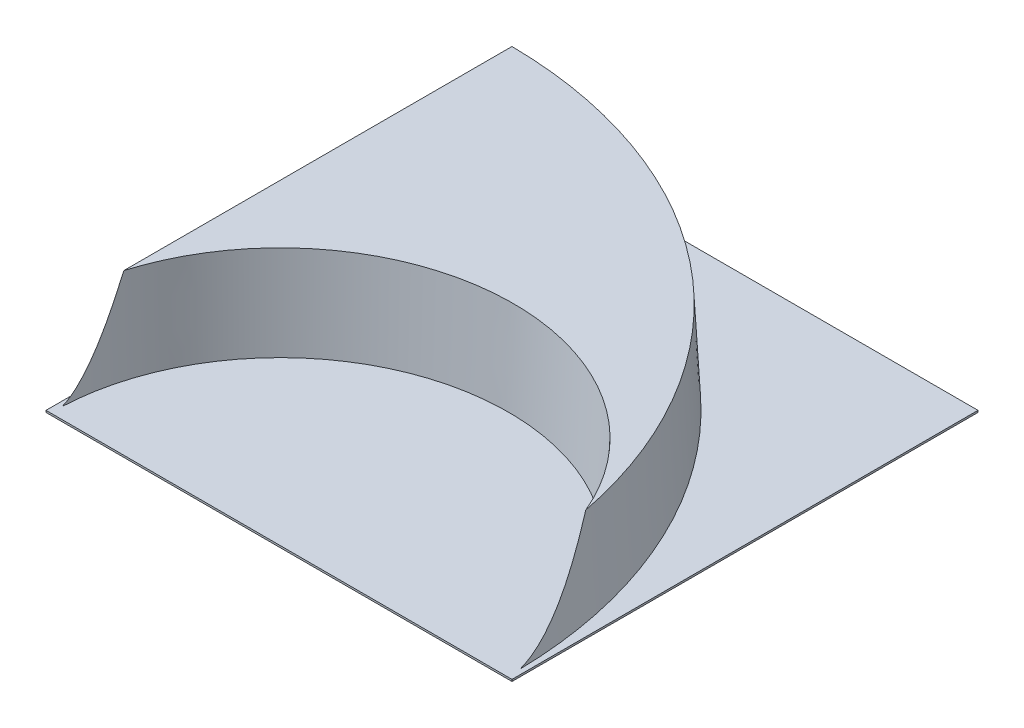
ISO-10303-21;
HEADER;
FILE_DESCRIPTION(('STEP AP214'),'2;1');
FILE_NAME('part.step','',(''),(''),'','','');
FILE_SCHEMA(('AUTOMOTIVE_DESIGN { 1 0 10303 214 1 1 1 1 }'));
ENDSEC;
DATA;
#1=APPLICATION_CONTEXT('core data for automotive mechanical design processes');
#2=APPLICATION_PROTOCOL_DEFINITION('international standard','automotive_design',2000,#1);
#3=PRODUCT_CONTEXT('',#1,'mechanical');
#4=PRODUCT('Part','Part','',(#3));
#5=PRODUCT_RELATED_PRODUCT_CATEGORY('part','',(#4));
#6=PRODUCT_DEFINITION_FORMATION('','',#4);
#7=PRODUCT_DEFINITION_CONTEXT('part definition',#1,'design');
#8=PRODUCT_DEFINITION('design','',#6,#7);
#9=PRODUCT_DEFINITION_SHAPE('','',#8);
#10=(LENGTH_UNIT() NAMED_UNIT(*) SI_UNIT(.MILLI.,.METRE.));
#11=(NAMED_UNIT(*) PLANE_ANGLE_UNIT() SI_UNIT($,.RADIAN.));
#12=(NAMED_UNIT(*) SI_UNIT($,.STERADIAN.) SOLID_ANGLE_UNIT());
#13=UNCERTAINTY_MEASURE_WITH_UNIT(LENGTH_MEASURE(1.E-05),#10,'distance_accuracy_value','');
#14=(GEOMETRIC_REPRESENTATION_CONTEXT(3) GLOBAL_UNCERTAINTY_ASSIGNED_CONTEXT((#13)) GLOBAL_UNIT_ASSIGNED_CONTEXT((#10,
#11,#12)) REPRESENTATION_CONTEXT('',''));
#15=CARTESIAN_POINT('',(0.,0.,0.));
#16=DIRECTION('',(0.,0.,1.));
#17=DIRECTION('',(1.,0.,0.));
#18=AXIS2_PLACEMENT_3D('',#15,#16,#17);
#19=CARTESIAN_POINT('',(-249.,-2.,-249.));
#20=DIRECTION('',(0.,0.,1.));
#21=DIRECTION('',(1.,0.,0.));
#22=AXIS2_PLACEMENT_3D('',#19,#20,#21);
#23=PLANE('',#22);
#24=DIRECTION('',(1.,0.,0.));
#25=VECTOR('',#24,1.);
#26=CARTESIAN_POINT('',(-249.,0.,-249.));
#27=LINE('',#26,#25);
#28=CARTESIAN_POINT('',(-249.,0.,-249.));
#29=VERTEX_POINT('',#28);
#30=CARTESIAN_POINT('',(249.,0.,-249.));
#31=VERTEX_POINT('',#30);
#32=EDGE_CURVE('E187',#29,#31,#27,.T.);
#33=ORIENTED_EDGE('',*,*,#32,.T.);
#34=DIRECTION('',(0.,1.,0.));
#35=VECTOR('',#34,1.);
#36=CARTESIAN_POINT('',(249.,-2.,-249.));
#37=LINE('',#36,#35);
#38=CARTESIAN_POINT('',(249.,-2.,-249.));
#39=VERTEX_POINT('',#38);
#40=EDGE_CURVE('E249',#39,#31,#37,.T.);
#41=ORIENTED_EDGE('',*,*,#40,.F.);
#42=DIRECTION('',(1.,0.,0.));
#43=VECTOR('',#42,1.);
#44=CARTESIAN_POINT('',(-249.,-2.,-249.));
#45=LINE('',#44,#43);
#46=CARTESIAN_POINT('',(-249.,-2.,-249.));
#47=VERTEX_POINT('',#46);
#48=EDGE_CURVE('E217',#47,#39,#45,.T.);
#49=ORIENTED_EDGE('',*,*,#48,.F.);
#50=DIRECTION('',(0.,1.,0.));
#51=VECTOR('',#50,1.);
#52=CARTESIAN_POINT('',(-249.,-2.,-249.));
#53=LINE('',#52,#51);
#54=EDGE_CURVE('E231',#47,#29,#53,.T.);
#55=ORIENTED_EDGE('',*,*,#54,.T.);
#56=EDGE_LOOP('',(#33,#41,#49,#55));
#57=FACE_BOUND('',#56,.T.);
#58=ADVANCED_FACE('F43',(#57),#23,.F.);
#59=CARTESIAN_POINT('',(249.,-2.,-249.));
#60=DIRECTION('',(-1.,0.,0.));
#61=DIRECTION('',(0.,0.,1.));
#62=AXIS2_PLACEMENT_3D('',#59,#60,#61);
#63=PLANE('',#62);
#64=DIRECTION('',(0.,0.,1.));
#65=VECTOR('',#64,1.);
#66=CARTESIAN_POINT('',(249.,0.,-249.));
#67=LINE('',#66,#65);
#68=CARTESIAN_POINT('',(249.,0.,249.));
#69=VERTEX_POINT('',#68);
#70=EDGE_CURVE('E234',#31,#69,#67,.T.);
#71=ORIENTED_EDGE('',*,*,#70,.T.);
#72=DIRECTION('',(0.,1.,0.));
#73=VECTOR('',#72,1.);
#74=CARTESIAN_POINT('',(249.,-2.,249.));
#75=LINE('',#74,#73);
#76=CARTESIAN_POINT('',(249.,-2.,249.));
#77=VERTEX_POINT('',#76);
#78=EDGE_CURVE('E247',#77,#69,#75,.T.);
#79=ORIENTED_EDGE('',*,*,#78,.F.);
#80=DIRECTION('',(0.,0.,1.));
#81=VECTOR('',#80,1.);
#82=CARTESIAN_POINT('',(249.,-2.,-249.));
#83=LINE('',#82,#81);
#84=EDGE_CURVE('E220',#39,#77,#83,.T.);
#85=ORIENTED_EDGE('',*,*,#84,.F.);
#86=ORIENTED_EDGE('',*,*,#40,.T.);
#87=EDGE_LOOP('',(#71,#79,#85,#86));
#88=FACE_BOUND('',#87,.T.);
#89=ADVANCED_FACE('F272',(#88),#63,.F.);
#90=CARTESIAN_POINT('',(-249.,-2.,249.));
#91=DIRECTION('',(0.,0.,1.));
#92=DIRECTION('',(1.,0.,0.));
#93=AXIS2_PLACEMENT_3D('',#90,#91,#92);
#94=PLANE('',#93);
#95=DIRECTION('',(1.,0.,0.));
#96=VECTOR('',#95,1.);
#97=CARTESIAN_POINT('',(-249.,0.,249.));
#98=LINE('',#97,#96);
#99=CARTESIAN_POINT('',(-249.,0.,249.));
#100=VERTEX_POINT('',#99);
#101=EDGE_CURVE('E238',#100,#69,#98,.T.);
#102=ORIENTED_EDGE('',*,*,#101,.F.);
#103=DIRECTION('',(0.,1.,0.));
#104=VECTOR('',#103,1.);
#105=CARTESIAN_POINT('',(-249.,-2.,249.));
#106=LINE('',#105,#104);
#107=CARTESIAN_POINT('',(-249.,-2.,249.));
#108=VERTEX_POINT('',#107);
#109=EDGE_CURVE('E245',#108,#100,#106,.T.);
#110=ORIENTED_EDGE('',*,*,#109,.F.);
#111=DIRECTION('',(1.,0.,0.));
#112=VECTOR('',#111,1.);
#113=CARTESIAN_POINT('',(-249.,-2.,249.));
#114=LINE('',#113,#112);
#115=EDGE_CURVE('E224',#108,#77,#114,.T.);
#116=ORIENTED_EDGE('',*,*,#115,.T.);
#117=ORIENTED_EDGE('',*,*,#78,.T.);
#118=EDGE_LOOP('',(#102,#110,#116,#117));
#119=FACE_BOUND('',#118,.T.);
#120=ADVANCED_FACE('F277',(#119),#94,.T.);
#121=CARTESIAN_POINT('',(-249.,-2.,-249.));
#122=DIRECTION('',(-1.,0.,0.));
#123=DIRECTION('',(0.,0.,1.));
#124=AXIS2_PLACEMENT_3D('',#121,#122,#123);
#125=PLANE('',#124);
#126=DIRECTION('',(0.,0.,1.));
#127=VECTOR('',#126,1.);
#128=CARTESIAN_POINT('',(-249.,0.,-249.));
#129=LINE('',#128,#127);
#130=EDGE_CURVE('E221',#29,#100,#129,.T.);
#131=ORIENTED_EDGE('',*,*,#130,.F.);
#132=ORIENTED_EDGE('',*,*,#54,.F.);
#133=DIRECTION('',(0.,0.,1.));
#134=VECTOR('',#133,1.);
#135=CARTESIAN_POINT('',(-249.,-2.,-249.));
#136=LINE('',#135,#134);
#137=EDGE_CURVE('E227',#47,#108,#136,.T.);
#138=ORIENTED_EDGE('',*,*,#137,.T.);
#139=ORIENTED_EDGE('',*,*,#109,.T.);
#140=EDGE_LOOP('',(#131,#132,#138,#139));
#141=FACE_BOUND('',#140,.T.);
#142=ADVANCED_FACE('F284',(#141),#125,.T.);
#143=CARTESIAN_POINT('',(0.,-2.,0.));
#144=DIRECTION('',(0.,-1.,0.));
#145=DIRECTION('',(0.,0.,-1.));
#146=AXIS2_PLACEMENT_3D('',#143,#144,#145);
#147=PLANE('',#146);
#148=CARTESIAN_POINT('',(-244.,-2.,244.));
#149=DIRECTION('',(0.,-1.,0.));
#150=DIRECTION('',(0.,0.,-1.));
#151=AXIS2_PLACEMENT_3D('',#148,#149,#150);
#152=CIRCLE('',#151,485.997255308004);
#153=CARTESIAN_POINT('',(-241.997255308004,-2.,-241.993128738063));
#154=VERTEX_POINT('',#153);
#155=CARTESIAN_POINT('',(238.830659233703,-2.,188.611493332449));
#156=VERTEX_POINT('',#155);
#157=EDGE_CURVE('E134',#154,#156,#152,.T.);
#158=ORIENTED_EDGE('',*,*,#157,.F.);
#159=DIRECTION('',(0.,0.,-1.));
#160=VECTOR('',#159,1.);
#161=CARTESIAN_POINT('',(-241.997255308004,-2.,0.));
#162=LINE('',#161,#160);
#163=CARTESIAN_POINT('',(-241.997255308004,-2.,203.329265280194));
#164=VERTEX_POINT('',#163);
#165=EDGE_CURVE('E119',#164,#154,#162,.T.);
#166=ORIENTED_EDGE('',*,*,#165,.F.);
#167=CARTESIAN_POINT('',(0.,-2.,247.696543837481));
#168=DIRECTION('',(0.,-1.,0.));
#169=DIRECTION('',(0.,0.,-1.));
#170=AXIS2_PLACEMENT_3D('',#167,#168,#169);
#171=CIRCLE('',#170,246.030743979664);
#172=EDGE_CURVE('E129',#164,#156,#171,.T.);
#173=ORIENTED_EDGE('',*,*,#172,.T.);
#174=EDGE_LOOP('',(#158,#166,#173));
#175=FACE_BOUND('',#174,.T.);
#176=ORIENTED_EDGE('',*,*,#48,.T.);
#177=ORIENTED_EDGE('',*,*,#84,.T.);
#178=ORIENTED_EDGE('',*,*,#115,.F.);
#179=ORIENTED_EDGE('',*,*,#137,.F.);
#180=EDGE_LOOP('',(#176,#177,#178,#179));
#181=FACE_BOUND('',#180,.T.);
#182=ADVANCED_FACE('F142',(#175,#181),#147,.T.);
#183=CARTESIAN_POINT('',(0.,0.,0.));
#184=DIRECTION('',(0.,-1.,0.));
#185=DIRECTION('',(0.,0.,-1.));
#186=AXIS2_PLACEMENT_3D('',#183,#184,#185);
#187=PLANE('',#186);
#188=CARTESIAN_POINT('',(0.,0.,247.696543837481));
#189=DIRECTION('',(0.,-1.,0.));
#190=DIRECTION('',(0.,0.,-1.));
#191=AXIS2_PLACEMENT_3D('',#188,#189,#190);
#192=CIRCLE('',#191,244.132814846235);
#193=CARTESIAN_POINT('',(-243.895184441434,-1.82865569106182E-13,236.927593516077));
#194=VERTEX_POINT('',#193);
#195=CARTESIAN_POINT('',(243.817466479364,0.,235.291934842022));
#196=VERTEX_POINT('',#195);
#197=EDGE_CURVE('E51',#194,#196,#192,.T.);
#198=ORIENTED_EDGE('',*,*,#197,.F.);
#199=DIRECTION('',(0.,0.,-1.));
#200=VECTOR('',#199,1.);
#201=CARTESIAN_POINT('',(-243.895184441434,0.,0.));
#202=LINE('',#201,#200);
#203=CARTESIAN_POINT('',(-243.895184441434,0.,-243.895173182559));
#204=VERTEX_POINT('',#203);
#205=EDGE_CURVE('E11',#194,#204,#202,.T.);
#206=ORIENTED_EDGE('',*,*,#205,.T.);
#207=CARTESIAN_POINT('',(-244.,0.,244.));
#208=DIRECTION('',(0.,-1.,0.));
#209=DIRECTION('',(0.,0.,-1.));
#210=AXIS2_PLACEMENT_3D('',#207,#208,#209);
#211=CIRCLE('',#210,487.895184441434);
#212=EDGE_CURVE('E252',#204,#196,#211,.T.);
#213=ORIENTED_EDGE('',*,*,#212,.T.);
#214=EDGE_LOOP('',(#198,#206,#213));
#215=FACE_BOUND('',#214,.T.);
#216=ORIENTED_EDGE('',*,*,#32,.F.);
#217=ORIENTED_EDGE('',*,*,#130,.T.);
#218=ORIENTED_EDGE('',*,*,#101,.T.);
#219=ORIENTED_EDGE('',*,*,#70,.F.);
#220=EDGE_LOOP('',(#216,#217,#218,#219));
#221=FACE_BOUND('',#220,.T.);
#222=ADVANCED_FACE('F258',(#215,#221),#187,.F.);
#223=CARTESIAN_POINT('',(-244.,-2.,244.));
#224=DIRECTION('',(-0.998629534754574,0.0523359562429439,0.));
#225=DIRECTION('',(-0.052335956242944,-0.998629534754574,0.));
#226=AXIS2_PLACEMENT_3D('',#223,#224,#225);
#227=PLANE('',#226);
#228=ORIENTED_EDGE('',*,*,#205,.F.);
#229=CARTESIAN_POINT('',(-238.759222071696,98.,176.079805776711));
#230=CARTESIAN_POINT('',(-238.848955156247,96.2877907482616,176.691310067576));
#231=CARTESIAN_POINT('',(-238.938559773883,94.578032791302,177.309724481718));
#232=CARTESIAN_POINT('',(-239.11748579046,91.1639210120117,178.561427647303));
#233=CARTESIAN_POINT('',(-239.206807184096,89.4595672908911,179.19471667547));
#234=CARTESIAN_POINT('',(-239.385166522264,86.0562683797866,180.477411886047));
#235=CARTESIAN_POINT('',(-239.474204363631,84.3573251582805,181.126823313486));
#236=CARTESIAN_POINT('',(-239.651931847282,80.9660827495771,182.442769835081));
#237=CARTESIAN_POINT('',(-239.740621491151,79.2737835321122,183.109304851124));
#238=CARTESIAN_POINT('',(-240.007801784323,74.1756798378286,185.149455745489));
#239=CARTESIAN_POINT('',(-240.185703422998,70.7811143533115,186.551451776626));
#240=CARTESIAN_POINT('',(-240.539506960993,64.030140684213,189.443722049961));
#241=CARTESIAN_POINT('',(-240.715409134595,60.6737272660483,190.933984005587));
#242=CARTESIAN_POINT('',(-241.051253737399,54.265430494109,193.902133912563));
#243=CARTESIAN_POINT('',(-241.211384491914,51.2099536793043,195.372184813923));
#244=CARTESIAN_POINT('',(-241.449448145749,46.6674285600993,197.659308607078));
#245=CARTESIAN_POINT('',(-241.528459352436,45.1598049254529,198.435484312182));
#246=CARTESIAN_POINT('',(-241.685647178449,42.1604825316462,200.018149044492));
#247=CARTESIAN_POINT('',(-241.763823805121,40.668783632324,200.824637804615));
#248=CARTESIAN_POINT('',(-241.918916732601,37.7094342837898,202.4683318147));
#249=CARTESIAN_POINT('',(-241.995836590333,36.2417159644034,203.305414298209));
#250=CARTESIAN_POINT('',(-242.148531386854,33.3281256804762,205.01710846674));
#251=CARTESIAN_POINT('',(-242.224306277665,31.8822546314139,205.891721718569));
#252=CARTESIAN_POINT('',(-242.374440934,29.0175147323285,207.682760988633));
#253=CARTESIAN_POINT('',(-242.448801395645,27.5986325995024,208.599165642585));
#254=CARTESIAN_POINT('',(-242.595840940675,24.792950942285,210.479789024293));
#255=CARTESIAN_POINT('',(-242.668520241702,23.4061472650328,211.444001511487));
#256=CARTESIAN_POINT('',(-242.80236153309,20.8523032895875,213.296436127047));
#257=CARTESIAN_POINT('',(-242.863778566548,19.6803964792176,214.177914686048));
#258=CARTESIAN_POINT('',(-242.984713455707,17.3728213288578,215.98755398455));
#259=CARTESIAN_POINT('',(-243.044231208978,16.2371549433602,216.915717234886));
#260=CARTESIAN_POINT('',(-243.161042014851,14.0082719898807,218.827010656181));
#261=CARTESIAN_POINT('',(-243.218329758266,12.9151567272571,219.810259850827));
#262=CARTESIAN_POINT('',(-243.32992348308,10.785821610591,221.836851133305));
#263=CARTESIAN_POINT('',(-243.384229955509,9.74959238713628,222.880183266827));
#264=CARTESIAN_POINT('',(-243.47949173378,7.9318893748281,224.838603076776));
#265=CARTESIAN_POINT('',(-243.521077652974,7.13838276641191,225.742454221872));
#266=CARTESIAN_POINT('',(-243.601111114824,5.61125334126129,227.600144952351));
#267=CARTESIAN_POINT('',(-243.639558206807,4.87763912388404,228.553991683934));
#268=CARTESIAN_POINT('',(-243.712311914762,3.48941567784588,230.508944673947));
#269=CARTESIAN_POINT('',(-243.746643259019,2.83433460540917,231.509712591615));
#270=CARTESIAN_POINT('',(-243.810503123765,1.61581579734053,233.565762934681));
#271=CARTESIAN_POINT('',(-243.840034456483,1.05232440117186,234.621012959082));
#272=CARTESIAN_POINT('',(-243.882682905815,0.238543509939713,236.356352689016));
#273=CARTESIAN_POINT('',(-243.897672231486,-0.047469862041061,237.01973498916));
#274=CARTESIAN_POINT('',(-243.925236748651,-0.573432181789776,238.364373452561));
#275=CARTESIAN_POINT('',(-243.93781297835,-0.813400939703747,239.045621785124));
#276=CARTESIAN_POINT('',(-243.960416045537,-1.24469315425471,240.431243970453));
#277=CARTESIAN_POINT('',(-243.970415171622,-1.43548784583812,241.135784124614));
#278=CARTESIAN_POINT('',(-243.987476050919,-1.76102881571302,242.558636824356));
#279=CARTESIAN_POINT('',(-243.99453401872,-1.89570286406548,243.276965881398));
#280=CARTESIAN_POINT('',(-244.,-2.00000000000015,244.));
#281=B_SPLINE_CURVE_WITH_KNOTS('',3,(#229,#230,#231,#232,#233,#234,#235,#236,#237,#238,#239,
#240,#241,#242,#243,#244,#245,#246,#247,#248,#249,#250,#251,#252,#253,#254,#255,#256,#257,#258,
#259,#260,#261,#262,#263,#264,#265,#266,#267,#268,#269,#270,#271,#272,#273,#274,#275,#276,#277,
#278,#279,#280),.UNSPECIFIED.,.F.,.F.,(4,2,2,2,2,2,2,2,2,2,2,2,2,2,2,2,2,2,2,2,2,2,2,2,2,4),(0.,
5.46102829517277,10.9221582670171,16.3850887887935,21.8479943946946,32.877863160625,
43.9062001663472,54.0876907344658,59.1800131881135,64.2722907845695,69.3459945317113,
74.4199102988155,79.4912606740202,84.5619507980836,88.9640527684992,93.3663917500266,
97.7786400630557,102.190159463064,105.798472179207,109.407302069524,112.993229185091,
116.577047746115,118.743303567743,120.908625283515,123.096341120716,125.286864020207),.UNSPECIFIED.);
#282=CARTESIAN_POINT('',(-238.759222071696,98.,176.079805776711));
#283=VERTEX_POINT('',#282);
#284=EDGE_CURVE('E179',#283,#194,#281,.T.);
#285=ORIENTED_EDGE('',*,*,#284,.F.);
#286=DIRECTION('',(0.,0.,-1.));
#287=VECTOR('',#286,1.);
#288=CARTESIAN_POINT('',(-238.759222071696,98.,244.));
#289=LINE('',#288,#287);
#290=CARTESIAN_POINT('',(-238.759222071696,98.,-238.730774595918));
#291=VERTEX_POINT('',#290);
#292=EDGE_CURVE('E128',#283,#291,#289,.T.);
#293=ORIENTED_EDGE('',*,*,#292,.T.);
#294=CARTESIAN_POINT('',(-238.759222071696,98.,-238.730774595918));
#295=CARTESIAN_POINT('',(-239.632671968299,81.3335831330251,-239.613732614432));
#296=CARTESIAN_POINT('',(-240.506128410674,64.6670413652918,-240.494313740744));
#297=CARTESIAN_POINT('',(-242.253054386776,31.3337080319584,-242.25072220877));
#298=CARTESIAN_POINT('',(-243.126523920502,14.6669164663584,-243.126549550486));
#299=CARTESIAN_POINT('',(-244.,-2.00000000000001,-244.));
#300=B_SPLINE_CURVE_WITH_KNOTS('',3,(#294,#295,#296,#297,#298,#299),.UNSPECIFIED.,.F.,.F.,(4,2,
4),(0.,50.1378866123321,100.275773213684),.UNSPECIFIED.);
#301=EDGE_CURVE('E188',#291,#204,#300,.T.);
#302=ORIENTED_EDGE('',*,*,#301,.T.);
#303=EDGE_LOOP('',(#228,#285,#293,#302));
#304=FACE_BOUND('',#303,.T.);
#305=ADVANCED_FACE('F194',(#304),#227,.T.);
#306=CARTESIAN_POINT('',(0.,-2.,247.696543837481));
#307=DIRECTION('',(0.,1.,0.));
#308=DIRECTION('',(0.,0.,-1.));
#309=AXIS2_PLACEMENT_3D('',#306,#307,#308);
#310=CONICAL_SURFACE('',#309,244.027999287669,0.05235987755983);
#311=ORIENTED_EDGE('',*,*,#284,.T.);
#312=ORIENTED_EDGE('',*,*,#197,.T.);
#313=CARTESIAN_POINT('',(229.6881881763,98.,150.855129623133));
#314=CARTESIAN_POINT('',(229.977686766097,96.0674663068534,151.802499128545));
#315=CARTESIAN_POINT('',(230.266134799081,94.1404856822678,152.761581776974));
#316=CARTESIAN_POINT('',(230.840722301913,90.2987880971063,154.704853407672));
#317=CARTESIAN_POINT('',(231.126861681348,88.3840716174271,155.68904336699));
#318=CARTESIAN_POINT('',(231.696790867189,84.566944577179,157.684798048762));
#319=CARTESIAN_POINT('',(231.980578988412,82.6645430259931,158.696380503708));
#320=CARTESIAN_POINT('',(232.545350582894,78.8748210764327,160.748156283346));
#321=CARTESIAN_POINT('',(232.82633408045,76.9875005474373,161.788349359886));
#322=CARTESIAN_POINT('',(233.391003430261,73.190603221162,163.92134251124));
#323=CARTESIAN_POINT('',(233.674624244559,71.2813780347889,165.014786450731));
#324=CARTESIAN_POINT('',(234.238262602991,67.4825279815474,167.236098921902));
#325=CARTESIAN_POINT('',(234.518280187491,65.5929028951504,168.36396706746));
#326=CARTESIAN_POINT('',(235.074216400079,61.8361644551989,170.656631394868));
#327=CARTESIAN_POINT('',(235.350135970913,59.9690459432377,171.821418883967));
#328=CARTESIAN_POINT('',(235.897429910735,56.2598361213937,174.191271113535));
#329=CARTESIAN_POINT('',(236.168804284523,54.4177447850767,175.396335811458));
#330=CARTESIAN_POINT('',(236.707189771039,50.7567470748295,177.853852360117));
#331=CARTESIAN_POINT('',(236.974185665066,48.9379250442377,179.106433417569));
#332=CARTESIAN_POINT('',(237.502253690694,45.3333306212825,181.659608752403));
#333=CARTESIAN_POINT('',(237.763325771255,43.5475585136997,182.960203443214));
#334=CARTESIAN_POINT('',(238.27881935866,40.0131704553665,185.614762300449));
#335=CARTESIAN_POINT('',(238.533236314701,38.2645800750257,186.968761476268));
#336=CARTESIAN_POINT('',(239.034137344404,34.8123054267418,189.734339807296));
#337=CARTESIAN_POINT('',(239.280621570635,33.1086202952519,191.145917853909));
#338=CARTESIAN_POINT('',(239.762747393561,29.7650156004478,194.022989657267));
#339=CARTESIAN_POINT('',(239.998448799092,28.1247549275749,195.488075724478));
#340=CARTESIAN_POINT('',(240.45907219642,24.9061745568092,198.486927079611));
#341=CARTESIAN_POINT('',(240.683993229196,23.3278603719188,200.020698454376));
#342=CARTESIAN_POINT('',(241.120704264935,20.2477033591263,203.161343829054));
#343=CARTESIAN_POINT('',(241.332510974825,18.7457636894627,204.768120100839));
#344=CARTESIAN_POINT('',(241.740711278441,15.8320845232813,208.062928096471));
#345=CARTESIAN_POINT('',(241.937109310958,14.4203190721492,209.750936192062));
#346=CARTESIAN_POINT('',(242.289253544538,11.8665902518937,213.010186584791));
#347=CARTESIAN_POINT('',(242.447060227973,10.7124674658441,214.571615852727));
#348=CARTESIAN_POINT('',(242.67096226048,9.05756892315066,216.967466939023));
#349=CARTESIAN_POINT('',(242.743462943736,8.51864021190546,217.775052055215));
#350=CARTESIAN_POINT('',(242.88385116929,7.46833507295602,219.408777901653));
#351=CARTESIAN_POINT('',(242.95173689414,6.95696951631368,220.234925773757));
#352=CARTESIAN_POINT('',(243.147240790117,5.4727941270738,222.733448109387));
#353=CARTESIAN_POINT('',(243.267412148927,4.54469164952314,224.433381002598));
#354=CARTESIAN_POINT('',(243.484276314911,2.83093219419026,227.904662926892));
#355=CARTESIAN_POINT('',(243.580981686591,2.04519904425893,229.675973144976));
#356=CARTESIAN_POINT('',(243.710453130835,0.9511046956217,232.484748551047));
#357=CARTESIAN_POINT('',(243.752565762192,0.585469263494145,233.499680842003));
#358=CARTESIAN_POINT('',(243.827776795653,-0.0902495735157118,235.54801567303));
#359=CARTESIAN_POINT('',(243.860877633394,-0.400347980742159,236.581413141854));
#360=CARTESIAN_POINT('',(243.917675718331,-0.962941963506119,238.671095203705));
#361=CARTESIAN_POINT('',(243.941312259003,-1.21506139305661,239.72748312065));
#362=CARTESIAN_POINT('',(243.978415436142,-1.65596379423103,241.854223126166));
#363=CARTESIAN_POINT('',(243.991875796571,-1.84470763990533,242.924583418805));
#364=CARTESIAN_POINT('',(244.,-1.99999999999965,244.));
#365=B_SPLINE_CURVE_WITH_KNOTS('',3,(#313,#314,#315,#316,#317,#318,#319,#320,#321,#322,#323,
#324,#325,#326,#327,#328,#329,#330,#331,#332,#333,#334,#335,#336,#337,#338,#339,#340,#341,#342,
#343,#344,#345,#346,#347,#348,#349,#350,#351,#352,#353,#354,#355,#356,#357,#358,#359,#360,#361,
#362,#363,#364),.UNSPECIFIED.,.F.,.F.,(4,2,2,2,2,2,2,2,2,2,2,2,2,2,2,2,2,2,2,2,2,2,2,2,2,4),(0.,
6.51491193674741,13.0300777885528,19.5495671048448,26.0689998926318,32.723806099131,
39.3785376886027,46.0317138772123,52.6848830380626,59.3576628100299,66.0305000524329,
72.7077868591881,79.3849451650993,86.0189240002442,92.6534919017548,99.2794260316601,
105.903444361124,111.743772522794,114.664054825661,117.585480600699,123.400960698491,
129.213320080922,132.450745918821,135.68729590001,138.944285621361,142.203282417162),.UNSPECIFIED.);
#366=CARTESIAN_POINT('',(229.6881881763,98.,150.855129623133));
#367=VERTEX_POINT('',#366);
#368=EDGE_CURVE('E66',#367,#196,#365,.T.);
#369=ORIENTED_EDGE('',*,*,#368,.F.);
#370=CARTESIAN_POINT('',(0.,98.,247.696543837481));
#371=DIRECTION('',(0.,-1.,0.));
#372=DIRECTION('',(0.,0.,-1.));
#373=AXIS2_PLACEMENT_3D('',#370,#371,#372);
#374=CIRCLE('',#373,249.268777215973);
#375=EDGE_CURVE('E213',#283,#367,#374,.T.);
#376=ORIENTED_EDGE('',*,*,#375,.F.);
#377=EDGE_LOOP('',(#311,#312,#369,#376));
#378=FACE_BOUND('',#377,.T.);
#379=ADVANCED_FACE('F197',(#378),#310,.F.);
#380=CARTESIAN_POINT('',(-244.,-2.,244.));
#381=DIRECTION('',(0.,-1.,0.));
#382=DIRECTION('',(0.,0.,-1.));
#383=AXIS2_PLACEMENT_3D('',#380,#381,#382);
#384=CONICAL_SURFACE('',#383,488.,0.05235987755983);
#385=ORIENTED_EDGE('',*,*,#212,.F.);
#386=ORIENTED_EDGE('',*,*,#301,.F.);
#387=CARTESIAN_POINT('',(-244.,98.,244.));
#388=DIRECTION('',(0.,-1.,0.));
#389=DIRECTION('',(0.,0.,-1.));
#390=AXIS2_PLACEMENT_3D('',#387,#388,#389);
#391=CIRCLE('',#390,482.759222071696);
#392=EDGE_CURVE('E212',#291,#367,#391,.T.);
#393=ORIENTED_EDGE('',*,*,#392,.T.);
#394=ORIENTED_EDGE('',*,*,#368,.T.);
#395=EDGE_LOOP('',(#385,#386,#393,#394));
#396=FACE_BOUND('',#395,.T.);
#397=ADVANCED_FACE('F200',(#396),#384,.T.);
#398=CARTESIAN_POINT('',(-244.,98.,244.));
#399=DIRECTION('',(0.,-1.,0.));
#400=DIRECTION('',(0.,0.,-1.));
#401=AXIS2_PLACEMENT_3D('',#398,#399,#400);
#402=PLANE('',#401);
#403=ORIENTED_EDGE('',*,*,#292,.F.);
#404=ORIENTED_EDGE('',*,*,#375,.T.);
#405=ORIENTED_EDGE('',*,*,#392,.F.);
#406=EDGE_LOOP('',(#403,#404,#405));
#407=FACE_BOUND('',#406,.T.);
#408=ADVANCED_FACE('F265',(#407),#402,.F.);
#409=CARTESIAN_POINT('',(-242.002740930491,-2.10467191248589,244.));
#410=DIRECTION('',(-0.998629534754574,0.0523359562429439,0.));
#411=DIRECTION('',(-0.052335956242944,-0.998629534754574,0.));
#412=AXIS2_PLACEMENT_3D('',#409,#410,#411);
#413=PLANE('',#412);
#414=ORIENTED_EDGE('',*,*,#165,.T.);
#415=CARTESIAN_POINT('',(-236.861292938266,96.,-236.808300581165));
#416=CARTESIAN_POINT('',(-237.717273888162,79.6669104929418,-237.677059932117));
#417=CARTESIAN_POINT('',(-238.5732612273,63.3336990718801,-238.543508620713));
#418=CARTESIAN_POINT('',(-240.28524868388,30.6670324052134,-240.271784673012));
#419=CARTESIAN_POINT('',(-241.141248801321,14.3335771596084,-241.133612036715));
#420=CARTESIAN_POINT('',(-241.997255308004,-2.00000000000002,-241.993128738063));
#421=B_SPLINE_CURVE_WITH_KNOTS('',3,(#415,#416,#417,#418,#419,#420),.UNSPECIFIED.,.F.,.F.,(4,2,
4),(0.,49.135681401793,98.271362793167),.UNSPECIFIED.);
#422=CARTESIAN_POINT('',(-236.861292938266,96.,-236.808300581165));
#423=VERTEX_POINT('',#422);
#424=EDGE_CURVE('E122',#423,#154,#421,.T.);
#425=ORIENTED_EDGE('',*,*,#424,.F.);
#426=DIRECTION('',(0.,0.,-1.));
#427=VECTOR('',#426,1.);
#428=CARTESIAN_POINT('',(-236.861292938266,96.,244.));
#429=LINE('',#428,#427);
#430=CARTESIAN_POINT('',(-236.861292938266,96.,164.141518339191));
#431=VERTEX_POINT('',#430);
#432=EDGE_CURVE('E157',#431,#423,#429,.T.);
#433=ORIENTED_EDGE('',*,*,#432,.F.);
#434=CARTESIAN_POINT('',(-236.861292938266,96.,164.141518339191));
#435=CARTESIAN_POINT('',(-236.97178962389,93.891597638072,164.786926806901));
#436=CARTESIAN_POINT('',(-237.082177807294,91.7852656218183,165.43914072373));
#437=CARTESIAN_POINT('',(-237.302716552787,87.5771356741323,166.758147962327));
#438=CARTESIAN_POINT('',(-237.412867112347,85.4753377909457,167.424941438396));
#439=CARTESIAN_POINT('',(-237.632909765189,81.2766738549277,168.774075629354));
#440=CARTESIAN_POINT('',(-237.742801853468,79.179807897583,169.456416642568));
#441=CARTESIAN_POINT('',(-237.962298668492,74.9915591675825,170.837739636246));
#442=CARTESIAN_POINT('',(-238.071903395947,72.9001763814017,171.53672157562));
#443=CARTESIAN_POINT('',(-238.399643357959,66.6465253682075,173.656539774141));
#444=CARTESIAN_POINT('',(-238.617310314999,62.493192408531,175.103949072479));
#445=CARTESIAN_POINT('',(-239.051116701648,54.2156734488738,178.081384537099));
#446=CARTESIAN_POINT('',(-239.267256017808,50.0914896136315,179.611416767899));
#447=CARTESIAN_POINT('',(-239.590068101152,43.9318681268949,181.980282851468));
#448=CARTESIAN_POINT('',(-239.697478002665,41.882365114518,182.78251209246));
#449=CARTESIAN_POINT('',(-239.911738321478,37.7940346844907,184.4138235779));
#450=CARTESIAN_POINT('',(-240.018588741424,35.7552072163525,185.242905695219));
#451=CARTESIAN_POINT('',(-240.231626908884,31.6901968233459,186.930440258765));
#452=CARTESIAN_POINT('',(-240.337814791008,29.664011329965,187.788886492918));
#453=CARTESIAN_POINT('',(-240.54944971414,25.6257764337702,189.538482035923));
#454=CARTESIAN_POINT('',(-240.654896764148,23.6137268592646,190.429630946755));
#455=CARTESIAN_POINT('',(-240.865215292742,19.600610267201,192.250880909661));
#456=CARTESIAN_POINT('',(-240.9700844058,17.5995883866034,193.181081905897));
#457=CARTESIAN_POINT('',(-241.178790784551,13.6172334460612,195.08260418052));
#458=CARTESIAN_POINT('',(-241.282628109993,11.6358992460191,196.053923060467));
#459=CARTESIAN_POINT('',(-241.489156866117,7.69509582047501,198.043957330649));
#460=CARTESIAN_POINT('',(-241.591847354636,5.73564457250269,199.062708579071));
#461=CARTESIAN_POINT('',(-241.7447679213,2.81774633762501,200.63094921194));
#462=CARTESIAN_POINT('',(-241.795560862819,1.8485592777302,201.160439481184));
#463=CARTESIAN_POINT('',(-241.896730986413,-0.0818816792741603,202.233808490492));
#464=CARTESIAN_POINT('',(-241.947108152314,-1.0431352677765,202.777687786851));
#465=CARTESIAN_POINT('',(-241.997255308004,-2.00000000000001,203.329265280194));
#466=B_SPLINE_CURVE_WITH_KNOTS('',3,(#434,#435,#436,#437,#438,#439,#440,#441,#442,#443,#444,
#445,#446,#447,#448,#449,#450,#451,#452,#453,#454,#455,#456,#457,#458,#459,#460,#461,#462,#463,
#464,#465),.UNSPECIFIED.,.F.,.F.,(4,2,2,2,2,2,2,2,2,2,2,2,2,2,2,4),(0.,6.62322245951613,
13.2465150495647,19.869934834407,26.4933382664596,39.7036846984154,52.9150020905994,
59.5254558929287,66.1358784041367,72.7449110045998,79.3538631940428,85.9809056175621,
92.6075620113436,99.2393120908282,102.55588442734,105.87258517412),.UNSPECIFIED.);
#467=EDGE_CURVE('E58',#431,#164,#466,.T.);
#468=ORIENTED_EDGE('',*,*,#467,.T.);
#469=EDGE_LOOP('',(#414,#425,#433,#468));
#470=FACE_BOUND('',#469,.T.);
#471=ADVANCED_FACE('F121',(#470),#413,.F.);
#472=CARTESIAN_POINT('',(0.,-2.10467191248589,247.696543837481));
#473=DIRECTION('',(0.,1.,0.));
#474=DIRECTION('',(0.,0.,-1.));
#475=AXIS2_PLACEMENT_3D('',#472,#473,#474);
#476=CONICAL_SURFACE('',#475,246.025258357178,0.05235987755983);
#477=ORIENTED_EDGE('',*,*,#467,.F.);
#478=CARTESIAN_POINT('',(0.,96.,247.696543837481));
#479=DIRECTION('',(0.,-1.,0.));
#480=DIRECTION('',(0.,0.,-1.));
#481=AXIS2_PLACEMENT_3D('',#478,#479,#480);
#482=CIRCLE('',#481,251.166706349403);
#483=CARTESIAN_POINT('',(224.241101677843,96.,134.556618538256));
#484=VERTEX_POINT('',#483);
#485=EDGE_CURVE('E140',#431,#484,#482,.T.);
#486=ORIENTED_EDGE('',*,*,#485,.T.);
#487=CARTESIAN_POINT('',(224.241101677843,96.,134.556618538256));
#488=CARTESIAN_POINT('',(224.567208960936,93.8394125782243,135.454353401589));
#489=CARTESIAN_POINT('',(224.892542237891,91.6827962504504,136.361965219666));
#490=CARTESIAN_POINT('',(225.541530974909,87.3782135010607,138.198165923607));
#491=CARTESIAN_POINT('',(225.865186403945,85.2302472395599,139.126755195686));
#492=CARTESIAN_POINT('',(226.510703089078,80.9435828382716,141.006175145651));
#493=CARTESIAN_POINT('',(226.832564201532,78.8048854434567,141.957007573399));
#494=CARTESIAN_POINT('',(227.474307299768,74.5378115633553,143.88219600503));
#495=CARTESIAN_POINT('',(227.794189294379,72.4094350320277,144.856551903859));
#496=CARTESIAN_POINT('',(228.430367452762,68.1735046586359,146.825851004007));
#497=CARTESIAN_POINT('',(228.746673265897,66.0659002361803,147.820682214095));
#498=CARTESIAN_POINT('',(229.376947465873,61.8630128329744,149.836756521744));
#499=CARTESIAN_POINT('',(229.690915863436,59.7677297957104,150.857999498048));
#500=CARTESIAN_POINT('',(230.316317098613,55.5905620193177,152.928799690085));
#501=CARTESIAN_POINT('',(230.627749697016,53.5086785480041,153.978359537657));
#502=CARTESIAN_POINT('',(231.247781601076,49.3600206528076,156.107691376231));
#503=CARTESIAN_POINT('',(231.55638094925,47.2932460022906,157.187462912877));
#504=CARTESIAN_POINT('',(232.170802351176,43.1741098751697,159.380743821034));
#505=CARTESIAN_POINT('',(232.47662076666,41.1217679063471,160.494290887601));
#506=CARTESIAN_POINT('',(233.084758357572,37.0359620978514,162.756437965676));
#507=CARTESIAN_POINT('',(233.387077550586,35.0024981633088,163.905037800905));
#508=CARTESIAN_POINT('',(233.98772081383,30.9573584671987,166.239821043957));
#509=CARTESIAN_POINT('',(234.286045908697,28.9456771439073,167.425994539292));
#510=CARTESIAN_POINT('',(234.878281535522,24.9464373420428,169.839381340358));
#511=CARTESIAN_POINT('',(235.172192139484,22.9588784701157,171.066593975654));
#512=CARTESIAN_POINT('',(235.756313948863,19.0024482204143,173.571262647157));
#513=CARTESIAN_POINT('',(236.046502812358,17.0336997030068,174.84891833442));
#514=CARTESIAN_POINT('',(236.621097031209,13.1282527136379,177.453359183369));
#515=CARTESIAN_POINT('',(236.905502758297,11.1915521831837,178.780141171733));
#516=CARTESIAN_POINT('',(237.467961065702,7.35323108402331,181.488989629401));
#517=CARTESIAN_POINT('',(237.746007135785,5.45164681561193,182.871109087165));
#518=CARTESIAN_POINT('',(238.157301166241,2.63169688796555,184.98895436648));
#519=CARTESIAN_POINT('',(238.293452727172,1.6970072807975,185.702435836674));
#520=CARTESIAN_POINT('',(238.563665208603,-0.160582598632046,187.145043301636));
#521=CARTESIAN_POINT('',(238.697726045263,-1.08348239784848,187.874169921013));
#522=CARTESIAN_POINT('',(238.830659233703,-1.99999999999991,188.61149333245));
#523=B_SPLINE_CURVE_WITH_KNOTS('',3,(#487,#488,#489,#490,#491,#492,#493,#494,#495,#496,#497,
#498,#499,#500,#501,#502,#503,#504,#505,#506,#507,#508,#509,#510,#511,#512,#513,#514,#515,#516,
#517,#518,#519,#520,#521,#522),.UNSPECIFIED.,.F.,.F.,(4,2,2,2,2,2,2,2,2,2,2,2,2,2,2,2,2,4),(0.,
7.08686612117124,14.1738628246629,21.2614189476365,28.3489434240769,35.404666387378,
42.4603569632981,49.5167055867738,56.5729481461032,63.6373786826276,70.7017736984453,
77.7643202946064,84.8267515698648,91.9206771027352,99.0141451989118,106.11457619205,
109.665647870692,113.216861585067),.UNSPECIFIED.);
#524=EDGE_CURVE('E139',#484,#156,#523,.T.);
#525=ORIENTED_EDGE('',*,*,#524,.T.);
#526=ORIENTED_EDGE('',*,*,#172,.F.);
#527=EDGE_LOOP('',(#477,#486,#525,#526));
#528=FACE_BOUND('',#527,.T.);
#529=ADVANCED_FACE('F159',(#528),#476,.T.);
#530=CARTESIAN_POINT('',(-244.,-2.10467191248589,244.));
#531=DIRECTION('',(0.,-1.,0.));
#532=DIRECTION('',(0.,0.,-1.));
#533=AXIS2_PLACEMENT_3D('',#530,#531,#532);
#534=CONICAL_SURFACE('',#533,486.002740930491,0.05235987755983);
#535=ORIENTED_EDGE('',*,*,#157,.T.);
#536=ORIENTED_EDGE('',*,*,#524,.F.);
#537=CARTESIAN_POINT('',(-244.,96.,244.));
#538=DIRECTION('',(0.,-1.,0.));
#539=DIRECTION('',(0.,0.,-1.));
#540=AXIS2_PLACEMENT_3D('',#537,#538,#539);
#541=CIRCLE('',#540,480.861292938266);
#542=EDGE_CURVE('E137',#423,#484,#541,.T.);
#543=ORIENTED_EDGE('',*,*,#542,.F.);
#544=ORIENTED_EDGE('',*,*,#424,.T.);
#545=EDGE_LOOP('',(#535,#536,#543,#544));
#546=FACE_BOUND('',#545,.T.);
#547=ADVANCED_FACE('F132',(#546),#534,.F.);
#548=CARTESIAN_POINT('',(-244.,96.,244.));
#549=DIRECTION('',(0.,-1.,0.));
#550=DIRECTION('',(0.,0.,-1.));
#551=AXIS2_PLACEMENT_3D('',#548,#549,#550);
#552=PLANE('',#551);
#553=ORIENTED_EDGE('',*,*,#432,.T.);
#554=ORIENTED_EDGE('',*,*,#542,.T.);
#555=ORIENTED_EDGE('',*,*,#485,.F.);
#556=EDGE_LOOP('',(#553,#554,#555));
#557=FACE_BOUND('',#556,.T.);
#558=ADVANCED_FACE('F366',(#557),#552,.T.);
#559=CLOSED_SHELL('',(#58,#89,#120,#142,#182,#222,#305,#379,#397,#408,#471,#529,#547,#558));
#560=MANIFOLD_SOLID_BREP('B2',#559);
#561=ADVANCED_BREP_SHAPE_REPRESENTATION('',(#18,#560),#14);
#562=SHAPE_DEFINITION_REPRESENTATION(#9,#561);
ENDSEC;
END-ISO-10303-21;
